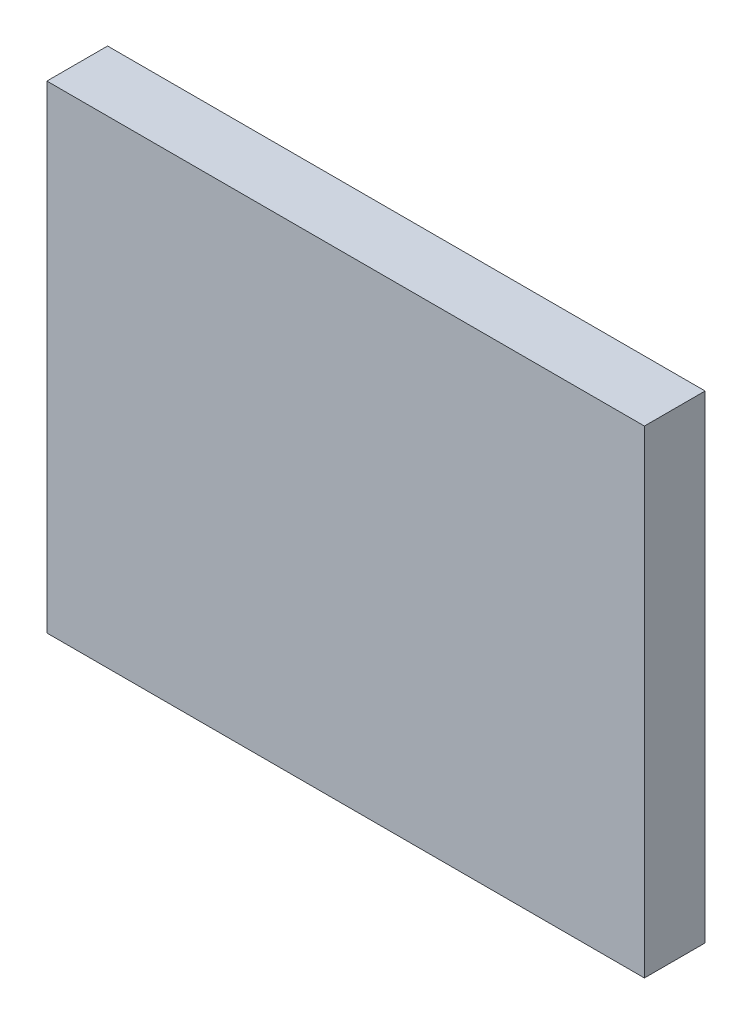
ISO-10303-21;
HEADER;
FILE_DESCRIPTION(('STEP AP214'),'2;1');
FILE_NAME('part.step','',(''),(''),'','','');
FILE_SCHEMA(('AUTOMOTIVE_DESIGN { 1 0 10303 214 1 1 1 1 }'));
ENDSEC;
DATA;
#1=APPLICATION_CONTEXT('core data for automotive mechanical design processes');
#2=APPLICATION_PROTOCOL_DEFINITION('international standard','automotive_design',2000,#1);
#3=PRODUCT_CONTEXT('',#1,'mechanical');
#4=PRODUCT('Part','Part','',(#3));
#5=PRODUCT_RELATED_PRODUCT_CATEGORY('part','',(#4));
#6=PRODUCT_DEFINITION_FORMATION('','',#4);
#7=PRODUCT_DEFINITION_CONTEXT('part definition',#1,'design');
#8=PRODUCT_DEFINITION('design','',#6,#7);
#9=PRODUCT_DEFINITION_SHAPE('','',#8);
#10=(LENGTH_UNIT() NAMED_UNIT(*) SI_UNIT(.MILLI.,.METRE.));
#11=(NAMED_UNIT(*) PLANE_ANGLE_UNIT() SI_UNIT($,.RADIAN.));
#12=(NAMED_UNIT(*) SI_UNIT($,.STERADIAN.) SOLID_ANGLE_UNIT());
#13=UNCERTAINTY_MEASURE_WITH_UNIT(LENGTH_MEASURE(1.E-05),#10,'distance_accuracy_value','');
#14=(GEOMETRIC_REPRESENTATION_CONTEXT(3) GLOBAL_UNCERTAINTY_ASSIGNED_CONTEXT((#13)) GLOBAL_UNIT_ASSIGNED_CONTEXT((#10,
#11,#12)) REPRESENTATION_CONTEXT('',''));
#15=CARTESIAN_POINT('',(0.,0.,0.));
#16=DIRECTION('',(0.,0.,1.));
#17=DIRECTION('',(1.,0.,0.));
#18=AXIS2_PLACEMENT_3D('',#15,#16,#17);
#19=CARTESIAN_POINT('',(1.25000004,0.99998784,0.254));
#20=DIRECTION('',(0.,0.,-1.));
#21=DIRECTION('',(-1.,0.,0.));
#22=AXIS2_PLACEMENT_3D('',#19,#20,#21);
#23=PLANE('',#22);
#24=DIRECTION('',(0.,1.,0.));
#25=VECTOR('',#24,1.);
#26=CARTESIAN_POINT('',(-1.25000004,0.99998784,0.254));
#27=LINE('',#26,#25);
#28=CARTESIAN_POINT('',(-1.25000004,0.99998784,0.254));
#29=VERTEX_POINT('',#28);
#30=CARTESIAN_POINT('',(-1.25000004,-0.99998784,0.254));
#31=VERTEX_POINT('',#30);
#32=EDGE_CURVE('E55',#29,#31,#27,.F.);
#33=ORIENTED_EDGE('',*,*,#32,.T.);
#34=DIRECTION('',(1.,0.,0.));
#35=VECTOR('',#34,1.);
#36=CARTESIAN_POINT('',(-1.25000004,-0.99998784,0.254));
#37=LINE('',#36,#35);
#38=CARTESIAN_POINT('',(1.25000004,-0.99998784,0.254));
#39=VERTEX_POINT('',#38);
#40=EDGE_CURVE('E57',#31,#39,#37,.T.);
#41=ORIENTED_EDGE('',*,*,#40,.T.);
#42=DIRECTION('',(0.,1.,0.));
#43=VECTOR('',#42,1.);
#44=CARTESIAN_POINT('',(1.25000004,-0.99998784,0.254));
#45=LINE('',#44,#43);
#46=CARTESIAN_POINT('',(1.25000004,0.99998784,0.254));
#47=VERTEX_POINT('',#46);
#48=EDGE_CURVE('E20',#39,#47,#45,.T.);
#49=ORIENTED_EDGE('',*,*,#48,.T.);
#50=DIRECTION('',(1.,0.,0.));
#51=VECTOR('',#50,1.);
#52=CARTESIAN_POINT('',(1.25000004,0.99998784,0.254));
#53=LINE('',#52,#51);
#54=EDGE_CURVE('E80',#47,#29,#53,.F.);
#55=ORIENTED_EDGE('',*,*,#54,.T.);
#56=EDGE_LOOP('',(#33,#41,#49,#55));
#57=FACE_BOUND('',#56,.T.);
#58=ADVANCED_FACE('F17',(#57),#23,.F.);
#59=CARTESIAN_POINT('',(1.25000004,-0.99998784,0.));
#60=DIRECTION('',(-1.,0.,0.));
#61=DIRECTION('',(0.,0.,1.));
#62=AXIS2_PLACEMENT_3D('',#59,#60,#61);
#63=PLANE('',#62);
#64=DIRECTION('',(0.,0.,-1.));
#65=VECTOR('',#64,1.);
#66=CARTESIAN_POINT('',(1.25000004,0.99998784,0.));
#67=LINE('',#66,#65);
#68=CARTESIAN_POINT('',(1.25000004,0.99998784,0.));
#69=VERTEX_POINT('',#68);
#70=EDGE_CURVE('E68',#69,#47,#67,.F.);
#71=ORIENTED_EDGE('',*,*,#70,.T.);
#72=ORIENTED_EDGE('',*,*,#48,.F.);
#73=DIRECTION('',(0.,0.,1.));
#74=VECTOR('',#73,1.);
#75=CARTESIAN_POINT('',(1.25000004,-0.99998784,0.));
#76=LINE('',#75,#74);
#77=CARTESIAN_POINT('',(1.25000004,-0.99998784,0.));
#78=VERTEX_POINT('',#77);
#79=EDGE_CURVE('E63',#39,#78,#76,.F.);
#80=ORIENTED_EDGE('',*,*,#79,.T.);
#81=DIRECTION('',(0.,1.,0.));
#82=VECTOR('',#81,1.);
#83=CARTESIAN_POINT('',(1.25000004,0.99998784,0.));
#84=LINE('',#83,#82);
#85=EDGE_CURVE('E83',#69,#78,#84,.F.);
#86=ORIENTED_EDGE('',*,*,#85,.F.);
#87=EDGE_LOOP('',(#71,#72,#80,#86));
#88=FACE_BOUND('',#87,.T.);
#89=ADVANCED_FACE('F65',(#88),#63,.F.);
#90=CARTESIAN_POINT('',(-1.25000004,-0.99998784,0.));
#91=DIRECTION('',(0.,1.,0.));
#92=DIRECTION('',(0.,0.,1.));
#93=AXIS2_PLACEMENT_3D('',#90,#91,#92);
#94=PLANE('',#93);
#95=ORIENTED_EDGE('',*,*,#79,.F.);
#96=ORIENTED_EDGE('',*,*,#40,.F.);
#97=DIRECTION('',(0.,0.,-1.));
#98=VECTOR('',#97,1.);
#99=CARTESIAN_POINT('',(-1.25000004,-0.99998784,0.));
#100=LINE('',#99,#98);
#101=CARTESIAN_POINT('',(-1.25000004,-0.99998784,0.));
#102=VERTEX_POINT('',#101);
#103=EDGE_CURVE('E75',#31,#102,#100,.T.);
#104=ORIENTED_EDGE('',*,*,#103,.T.);
#105=DIRECTION('',(-1.,0.,0.));
#106=VECTOR('',#105,1.);
#107=CARTESIAN_POINT('',(1.25000004,-0.99998784,0.));
#108=LINE('',#107,#106);
#109=EDGE_CURVE('E72',#78,#102,#108,.T.);
#110=ORIENTED_EDGE('',*,*,#109,.F.);
#111=EDGE_LOOP('',(#95,#96,#104,#110));
#112=FACE_BOUND('',#111,.T.);
#113=ADVANCED_FACE('F70',(#112),#94,.F.);
#114=CARTESIAN_POINT('',(-1.25000004,0.99998784,0.));
#115=DIRECTION('',(1.,0.,0.));
#116=DIRECTION('',(0.,0.,-1.));
#117=AXIS2_PLACEMENT_3D('',#114,#115,#116);
#118=PLANE('',#117);
#119=ORIENTED_EDGE('',*,*,#103,.F.);
#120=ORIENTED_EDGE('',*,*,#32,.F.);
#121=DIRECTION('',(0.,0.,-1.));
#122=VECTOR('',#121,1.);
#123=CARTESIAN_POINT('',(-1.25000004,0.99998784,0.));
#124=LINE('',#123,#122);
#125=CARTESIAN_POINT('',(-1.25000004,0.99998784,0.));
#126=VERTEX_POINT('',#125);
#127=EDGE_CURVE('E35',#29,#126,#124,.T.);
#128=ORIENTED_EDGE('',*,*,#127,.T.);
#129=DIRECTION('',(0.,1.,0.));
#130=VECTOR('',#129,1.);
#131=CARTESIAN_POINT('',(-1.25000004,0.99998784,0.));
#132=LINE('',#131,#130);
#133=EDGE_CURVE('E26',#102,#126,#132,.T.);
#134=ORIENTED_EDGE('',*,*,#133,.F.);
#135=EDGE_LOOP('',(#119,#120,#128,#134));
#136=FACE_BOUND('',#135,.T.);
#137=ADVANCED_FACE('F89',(#136),#118,.F.);
#138=CARTESIAN_POINT('',(1.25000004,0.99998784,0.));
#139=DIRECTION('',(0.,-1.,0.));
#140=DIRECTION('',(0.,0.,-1.));
#141=AXIS2_PLACEMENT_3D('',#138,#139,#140);
#142=PLANE('',#141);
#143=ORIENTED_EDGE('',*,*,#127,.F.);
#144=ORIENTED_EDGE('',*,*,#54,.F.);
#145=ORIENTED_EDGE('',*,*,#70,.F.);
#146=DIRECTION('',(-1.,0.,0.));
#147=VECTOR('',#146,1.);
#148=CARTESIAN_POINT('',(1.25000004,0.99998784,0.));
#149=LINE('',#148,#147);
#150=EDGE_CURVE('E11',#126,#69,#149,.F.);
#151=ORIENTED_EDGE('',*,*,#150,.F.);
#152=EDGE_LOOP('',(#143,#144,#145,#151));
#153=FACE_BOUND('',#152,.T.);
#154=ADVANCED_FACE('F91',(#153),#142,.F.);
#155=CARTESIAN_POINT('',(1.25000004,0.99998784,0.));
#156=DIRECTION('',(0.,0.,-1.));
#157=DIRECTION('',(-1.,0.,0.));
#158=AXIS2_PLACEMENT_3D('',#155,#156,#157);
#159=PLANE('',#158);
#160=ORIENTED_EDGE('',*,*,#133,.T.);
#161=ORIENTED_EDGE('',*,*,#150,.T.);
#162=ORIENTED_EDGE('',*,*,#85,.T.);
#163=ORIENTED_EDGE('',*,*,#109,.T.);
#164=EDGE_LOOP('',(#160,#161,#162,#163));
#165=FACE_BOUND('',#164,.T.);
#166=ADVANCED_FACE('F88',(#165),#159,.T.);
#167=CLOSED_SHELL('',(#58,#89,#113,#137,#154,#166));
#168=MANIFOLD_SOLID_BREP('B1',#167);
#169=ADVANCED_BREP_SHAPE_REPRESENTATION('',(#18,#168),#14);
#170=SHAPE_DEFINITION_REPRESENTATION(#9,#169);
ENDSEC;
END-ISO-10303-21;
